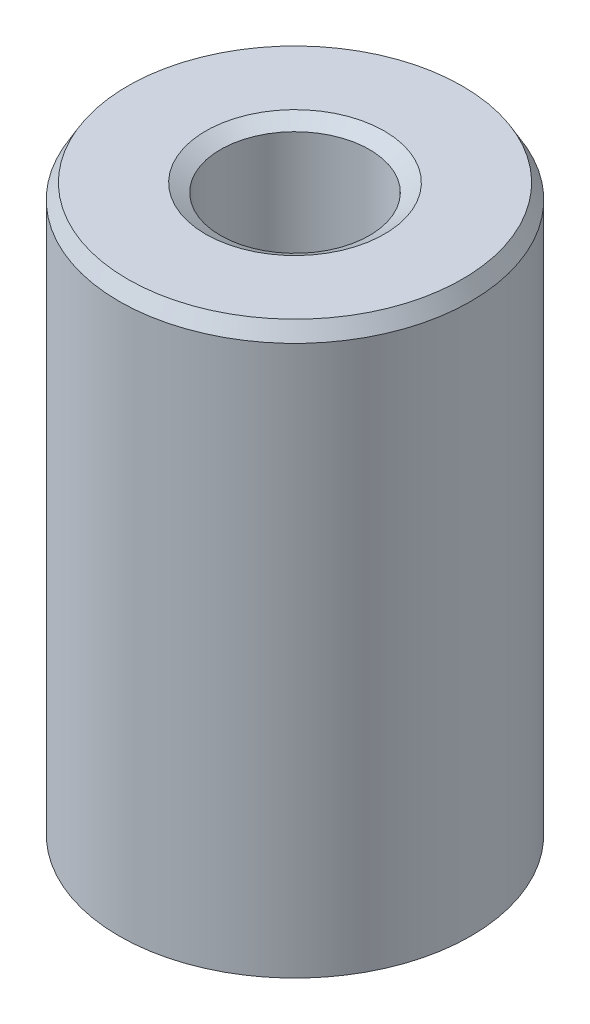
ISO-10303-21;
HEADER;
FILE_DESCRIPTION(('STEP AP214'),'2;1');
FILE_NAME('part.step','',(''),(''),'','','');
FILE_SCHEMA(('AUTOMOTIVE_DESIGN { 1 0 10303 214 1 1 1 1 }'));
ENDSEC;
DATA;
#1=APPLICATION_CONTEXT('core data for automotive mechanical design processes');
#2=APPLICATION_PROTOCOL_DEFINITION('international standard','automotive_design',2000,#1);
#3=PRODUCT_CONTEXT('',#1,'mechanical');
#4=PRODUCT('Part','Part','',(#3));
#5=PRODUCT_RELATED_PRODUCT_CATEGORY('part','',(#4));
#6=PRODUCT_DEFINITION_FORMATION('','',#4);
#7=PRODUCT_DEFINITION_CONTEXT('part definition',#1,'design');
#8=PRODUCT_DEFINITION('design','',#6,#7);
#9=PRODUCT_DEFINITION_SHAPE('','',#8);
#10=(LENGTH_UNIT() NAMED_UNIT(*) SI_UNIT(.MILLI.,.METRE.));
#11=(NAMED_UNIT(*) PLANE_ANGLE_UNIT() SI_UNIT($,.RADIAN.));
#12=(NAMED_UNIT(*) SI_UNIT($,.STERADIAN.) SOLID_ANGLE_UNIT());
#13=UNCERTAINTY_MEASURE_WITH_UNIT(LENGTH_MEASURE(1.E-05),#10,'distance_accuracy_value','');
#14=(GEOMETRIC_REPRESENTATION_CONTEXT(3) GLOBAL_UNCERTAINTY_ASSIGNED_CONTEXT((#13)) GLOBAL_UNIT_ASSIGNED_CONTEXT((#10,
#11,#12)) REPRESENTATION_CONTEXT('',''));
#15=CARTESIAN_POINT('',(0.,0.,0.));
#16=DIRECTION('',(0.,0.,1.));
#17=DIRECTION('',(1.,0.,0.));
#18=AXIS2_PLACEMENT_3D('',#15,#16,#17);
#19=CARTESIAN_POINT('',(0.,57.0157340789977,0.));
#20=DIRECTION('',(0.,-1.,0.));
#21=DIRECTION('',(0.,0.,-1.));
#22=AXIS2_PLACEMENT_3D('',#19,#20,#21);
#23=CYLINDRICAL_SURFACE('',#22,17.5);
#24=CARTESIAN_POINT('',(0.,0.85434815828557,0.));
#25=DIRECTION('',(0.,1.,0.));
#26=DIRECTION('',(0.,0.,1.));
#27=AXIS2_PLACEMENT_3D('',#24,#25,#26);
#28=CIRCLE('',#27,17.5);
#29=CARTESIAN_POINT('',(0.,0.85434815828557,17.5));
#30=VERTEX_POINT('',#29);
#31=EDGE_CURVE('E10',#30,#30,#28,.T.);
#32=ORIENTED_EDGE('',*,*,#31,.T.);
#33=EDGE_LOOP('',(#32));
#34=FACE_BOUND('',#33,.T.);
#35=CARTESIAN_POINT('',(0.,55.5359596614941,0.));
#36=DIRECTION('',(0.,1.,0.));
#37=DIRECTION('',(0.,0.,1.));
#38=AXIS2_PLACEMENT_3D('',#35,#36,#37);
#39=CIRCLE('',#38,17.5);
#40=CARTESIAN_POINT('',(0.,55.5359596614941,17.5));
#41=VERTEX_POINT('',#40);
#42=EDGE_CURVE('E50',#41,#41,#39,.F.);
#43=ORIENTED_EDGE('',*,*,#42,.T.);
#44=EDGE_LOOP('',(#43));
#45=FACE_BOUND('',#44,.T.);
#46=ADVANCED_FACE('F39',(#34,#45),#23,.T.);
#47=CARTESIAN_POINT('',(0.,57.0157340789977,0.));
#48=DIRECTION('',(0.,1.,0.));
#49=DIRECTION('',(0.,0.,1.));
#50=AXIS2_PLACEMENT_3D('',#47,#48,#49);
#51=PLANE('',#50);
#52=CARTESIAN_POINT('',(0.,57.0157340789977,0.));
#53=DIRECTION('',(0.,1.,0.));
#54=DIRECTION('',(0.,0.,1.));
#55=AXIS2_PLACEMENT_3D('',#52,#53,#54);
#56=CIRCLE('',#55,8.89121933085968);
#57=CARTESIAN_POINT('',(0.,57.0157340789977,8.89121933085968));
#58=VERTEX_POINT('',#57);
#59=EDGE_CURVE('E58',#58,#58,#56,.F.);
#60=ORIENTED_EDGE('',*,*,#59,.T.);
#61=EDGE_LOOP('',(#60));
#62=FACE_BOUND('',#61,.T.);
#63=CARTESIAN_POINT('',(0.,57.0157340789977,0.));
#64=DIRECTION('',(0.,1.,0.));
#65=DIRECTION('',(0.,0.,1.));
#66=AXIS2_PLACEMENT_3D('',#63,#64,#65);
#67=CIRCLE('',#66,16.6456518417144);
#68=CARTESIAN_POINT('',(0.,57.0157340789977,16.6456518417144));
#69=VERTEX_POINT('',#68);
#70=EDGE_CURVE('E61',#69,#69,#67,.T.);
#71=ORIENTED_EDGE('',*,*,#70,.T.);
#72=EDGE_LOOP('',(#71));
#73=FACE_BOUND('',#72,.T.);
#74=ADVANCED_FACE('F88',(#62,#73),#51,.T.);
#75=CARTESIAN_POINT('',(0.,0.,0.));
#76=DIRECTION('',(0.,1.,0.));
#77=DIRECTION('',(0.,0.,1.));
#78=AXIS2_PLACEMENT_3D('',#75,#76,#77);
#79=PLANE('',#78);
#80=CARTESIAN_POINT('',(0.,0.,0.));
#81=DIRECTION('',(0.,1.,0.));
#82=DIRECTION('',(0.,0.,1.));
#83=AXIS2_PLACEMENT_3D('',#80,#81,#82);
#84=CIRCLE('',#83,8.26579307164172);
#85=CARTESIAN_POINT('',(0.,0.,8.26579307164172));
#86=VERTEX_POINT('',#85);
#87=EDGE_CURVE('E51',#86,#86,#84,.T.);
#88=ORIENTED_EDGE('',*,*,#87,.T.);
#89=EDGE_LOOP('',(#88));
#90=FACE_BOUND('',#89,.T.);
#91=CARTESIAN_POINT('',(0.,0.,0.));
#92=DIRECTION('',(0.,1.,0.));
#93=DIRECTION('',(0.,0.,1.));
#94=AXIS2_PLACEMENT_3D('',#91,#92,#93);
#95=CIRCLE('',#94,16.0202255824965);
#96=CARTESIAN_POINT('',(0.,0.,16.0202255824965));
#97=VERTEX_POINT('',#96);
#98=EDGE_CURVE('E54',#97,#97,#95,.F.);
#99=ORIENTED_EDGE('',*,*,#98,.T.);
#100=EDGE_LOOP('',(#99));
#101=FACE_BOUND('',#100,.T.);
#102=ADVANCED_FACE('F83',(#90,#101),#79,.F.);
#103=CARTESIAN_POINT('',(0.,57.0157340789977,0.));
#104=DIRECTION('',(0.,-1.,0.));
#105=DIRECTION('',(0.,0.,-1.));
#106=AXIS2_PLACEMENT_3D('',#103,#104,#105);
#107=CYLINDRICAL_SURFACE('',#106,7.41144491335615);
#108=CARTESIAN_POINT('',(0.,56.1613859207121,0.));
#109=DIRECTION('',(0.,1.,0.));
#110=DIRECTION('',(0.,0.,1.));
#111=AXIS2_PLACEMENT_3D('',#108,#109,#110);
#112=CIRCLE('',#111,7.41144491335615);
#113=CARTESIAN_POINT('',(0.,56.1613859207121,7.41144491335615));
#114=VERTEX_POINT('',#113);
#115=EDGE_CURVE('E67',#114,#114,#112,.T.);
#116=ORIENTED_EDGE('',*,*,#115,.T.);
#117=EDGE_LOOP('',(#116));
#118=FACE_BOUND('',#117,.T.);
#119=CARTESIAN_POINT('',(0.,1.47977441750351,0.));
#120=DIRECTION('',(0.,1.,0.));
#121=DIRECTION('',(0.,0.,1.));
#122=AXIS2_PLACEMENT_3D('',#119,#120,#121);
#123=CIRCLE('',#122,7.41144491335615);
#124=CARTESIAN_POINT('',(0.,1.47977441750351,7.41144491335615));
#125=VERTEX_POINT('',#124);
#126=EDGE_CURVE('E69',#125,#125,#123,.F.);
#127=ORIENTED_EDGE('',*,*,#126,.T.);
#128=EDGE_LOOP('',(#127));
#129=FACE_BOUND('',#128,.T.);
#130=ADVANCED_FACE('F71',(#118,#129),#107,.F.);
#131=CARTESIAN_POINT('',(0.,56.1613859207121,0.));
#132=DIRECTION('',(0.,1.,0.));
#133=DIRECTION('',(0.,0.,1.));
#134=AXIS2_PLACEMENT_3D('',#131,#132,#133);
#135=CONICAL_SURFACE('',#134,7.41144491335615,1.0471975511966);
#136=ORIENTED_EDGE('',*,*,#59,.F.);
#137=EDGE_LOOP('',(#136));
#138=FACE_BOUND('',#137,.T.);
#139=ORIENTED_EDGE('',*,*,#115,.F.);
#140=EDGE_LOOP('',(#139));
#141=FACE_BOUND('',#140,.T.);
#142=ADVANCED_FACE('F77',(#138,#141),#135,.F.);
#143=CARTESIAN_POINT('',(0.,0.,0.));
#144=DIRECTION('',(0.,-1.,0.));
#145=DIRECTION('',(0.,0.,-1.));
#146=AXIS2_PLACEMENT_3D('',#143,#144,#145);
#147=CONICAL_SURFACE('',#146,8.26579307164172,0.523598775598298);
#148=ORIENTED_EDGE('',*,*,#126,.F.);
#149=EDGE_LOOP('',(#148));
#150=FACE_BOUND('',#149,.T.);
#151=ORIENTED_EDGE('',*,*,#87,.F.);
#152=EDGE_LOOP('',(#151));
#153=FACE_BOUND('',#152,.T.);
#154=ADVANCED_FACE('F73',(#150,#153),#147,.F.);
#155=CARTESIAN_POINT('',(0.,0.85434815828557,0.));
#156=DIRECTION('',(0.,1.,0.));
#157=DIRECTION('',(0.,0.,1.));
#158=AXIS2_PLACEMENT_3D('',#155,#156,#157);
#159=CONICAL_SURFACE('',#158,17.5,1.0471975511966);
#160=ORIENTED_EDGE('',*,*,#98,.F.);
#161=EDGE_LOOP('',(#160));
#162=FACE_BOUND('',#161,.T.);
#163=ORIENTED_EDGE('',*,*,#31,.F.);
#164=EDGE_LOOP('',(#163));
#165=FACE_BOUND('',#164,.T.);
#166=ADVANCED_FACE('F76',(#162,#165),#159,.T.);
#167=CARTESIAN_POINT('',(0.,57.0157340789977,0.));
#168=DIRECTION('',(0.,-1.,0.));
#169=DIRECTION('',(0.,0.,-1.));
#170=AXIS2_PLACEMENT_3D('',#167,#168,#169);
#171=CONICAL_SURFACE('',#170,16.6456518417144,0.5235987755983);
#172=ORIENTED_EDGE('',*,*,#42,.F.);
#173=EDGE_LOOP('',(#172));
#174=FACE_BOUND('',#173,.T.);
#175=ORIENTED_EDGE('',*,*,#70,.F.);
#176=EDGE_LOOP('',(#175));
#177=FACE_BOUND('',#176,.T.);
#178=ADVANCED_FACE('F45',(#174,#177),#171,.T.);
#179=CLOSED_SHELL('',(#46,#74,#102,#130,#142,#154,#166,#178));
#180=MANIFOLD_SOLID_BREP('B2',#179);
#181=ADVANCED_BREP_SHAPE_REPRESENTATION('',(#18,#180),#14);
#182=SHAPE_DEFINITION_REPRESENTATION(#9,#181);
ENDSEC;
END-ISO-10303-21;
